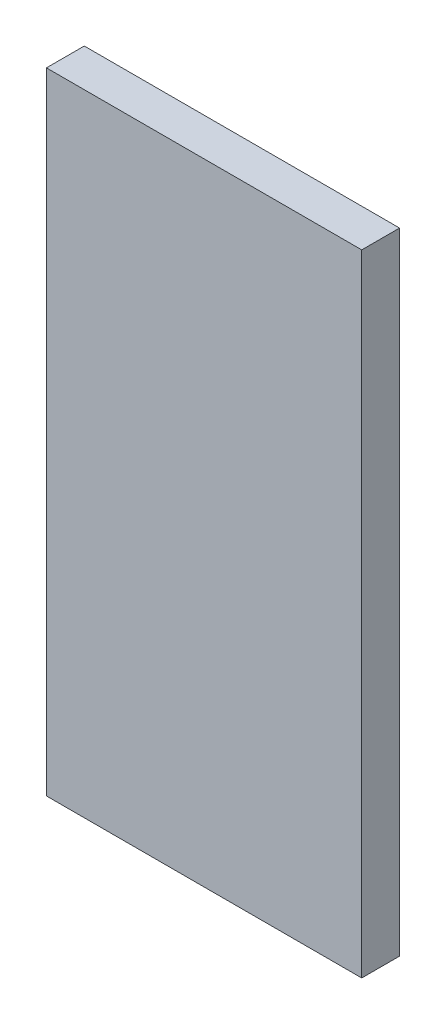
ISO-10303-21;
HEADER;
FILE_DESCRIPTION(('STEP AP214'),'2;1');
FILE_NAME('part.step','',(''),(''),'','','');
FILE_SCHEMA(('AUTOMOTIVE_DESIGN { 1 0 10303 214 1 1 1 1 }'));
ENDSEC;
DATA;
#1=APPLICATION_CONTEXT('core data for automotive mechanical design processes');
#2=APPLICATION_PROTOCOL_DEFINITION('international standard','automotive_design',2000,#1);
#3=PRODUCT_CONTEXT('',#1,'mechanical');
#4=PRODUCT('Part','Part','',(#3));
#5=PRODUCT_RELATED_PRODUCT_CATEGORY('part','',(#4));
#6=PRODUCT_DEFINITION_FORMATION('','',#4);
#7=PRODUCT_DEFINITION_CONTEXT('part definition',#1,'design');
#8=PRODUCT_DEFINITION('design','',#6,#7);
#9=PRODUCT_DEFINITION_SHAPE('','',#8);
#10=(LENGTH_UNIT() NAMED_UNIT(*) SI_UNIT(.MILLI.,.METRE.));
#11=(NAMED_UNIT(*) PLANE_ANGLE_UNIT() SI_UNIT($,.RADIAN.));
#12=(NAMED_UNIT(*) SI_UNIT($,.STERADIAN.) SOLID_ANGLE_UNIT());
#13=UNCERTAINTY_MEASURE_WITH_UNIT(LENGTH_MEASURE(1.E-05),#10,'distance_accuracy_value','');
#14=(GEOMETRIC_REPRESENTATION_CONTEXT(3) GLOBAL_UNCERTAINTY_ASSIGNED_CONTEXT((#13)) GLOBAL_UNIT_ASSIGNED_CONTEXT((#10,
#11,#12)) REPRESENTATION_CONTEXT('',''));
#15=CARTESIAN_POINT('',(0.,0.,0.));
#16=DIRECTION('',(0.,0.,1.));
#17=DIRECTION('',(1.,0.,0.));
#18=AXIS2_PLACEMENT_3D('',#15,#16,#17);
#19=CARTESIAN_POINT('',(-50.,-100.,12.));
#20=DIRECTION('',(1.,0.,0.));
#21=DIRECTION('',(0.,0.,-1.));
#22=AXIS2_PLACEMENT_3D('',#19,#20,#21);
#23=PLANE('',#22);
#24=DIRECTION('',(0.,-1.,0.));
#25=VECTOR('',#24,1.);
#26=CARTESIAN_POINT('',(-50.,-100.,0.));
#27=LINE('',#26,#25);
#28=CARTESIAN_POINT('',(-50.,100.,0.));
#29=VERTEX_POINT('',#28);
#30=CARTESIAN_POINT('',(-50.,-100.,0.));
#31=VERTEX_POINT('',#30);
#32=EDGE_CURVE('E96',#29,#31,#27,.T.);
#33=ORIENTED_EDGE('',*,*,#32,.T.);
#34=DIRECTION('',(0.,0.,-1.));
#35=VECTOR('',#34,1.);
#36=CARTESIAN_POINT('',(-50.,-100.,12.));
#37=LINE('',#36,#35);
#38=CARTESIAN_POINT('',(-50.,-100.,12.));
#39=VERTEX_POINT('',#38);
#40=EDGE_CURVE('E11',#39,#31,#37,.T.);
#41=ORIENTED_EDGE('',*,*,#40,.F.);
#42=DIRECTION('',(0.,-1.,0.));
#43=VECTOR('',#42,1.);
#44=CARTESIAN_POINT('',(-50.,-100.,12.));
#45=LINE('',#44,#43);
#46=CARTESIAN_POINT('',(-50.,100.,12.));
#47=VERTEX_POINT('',#46);
#48=EDGE_CURVE('E84',#47,#39,#45,.T.);
#49=ORIENTED_EDGE('',*,*,#48,.F.);
#50=DIRECTION('',(0.,0.,-1.));
#51=VECTOR('',#50,1.);
#52=CARTESIAN_POINT('',(-50.,100.,12.));
#53=LINE('',#52,#51);
#54=EDGE_CURVE('E92',#47,#29,#53,.T.);
#55=ORIENTED_EDGE('',*,*,#54,.T.);
#56=EDGE_LOOP('',(#33,#41,#49,#55));
#57=FACE_BOUND('',#56,.T.);
#58=ADVANCED_FACE('F33',(#57),#23,.F.);
#59=CARTESIAN_POINT('',(50.,-100.,12.));
#60=DIRECTION('',(0.,1.,0.));
#61=DIRECTION('',(0.,0.,1.));
#62=AXIS2_PLACEMENT_3D('',#59,#60,#61);
#63=PLANE('',#62);
#64=DIRECTION('',(1.,0.,0.));
#65=VECTOR('',#64,1.);
#66=CARTESIAN_POINT('',(50.,-100.,0.));
#67=LINE('',#66,#65);
#68=CARTESIAN_POINT('',(50.,-100.,0.));
#69=VERTEX_POINT('',#68);
#70=EDGE_CURVE('E88',#31,#69,#67,.T.);
#71=ORIENTED_EDGE('',*,*,#70,.T.);
#72=DIRECTION('',(0.,0.,-1.));
#73=VECTOR('',#72,1.);
#74=CARTESIAN_POINT('',(50.,-100.,12.));
#75=LINE('',#74,#73);
#76=CARTESIAN_POINT('',(50.,-100.,12.));
#77=VERTEX_POINT('',#76);
#78=EDGE_CURVE('E41',#77,#69,#75,.T.);
#79=ORIENTED_EDGE('',*,*,#78,.F.);
#80=DIRECTION('',(1.,0.,0.));
#81=VECTOR('',#80,1.);
#82=CARTESIAN_POINT('',(50.,-100.,12.));
#83=LINE('',#82,#81);
#84=EDGE_CURVE('E79',#39,#77,#83,.T.);
#85=ORIENTED_EDGE('',*,*,#84,.F.);
#86=ORIENTED_EDGE('',*,*,#40,.T.);
#87=EDGE_LOOP('',(#71,#79,#85,#86));
#88=FACE_BOUND('',#87,.T.);
#89=ADVANCED_FACE('F87',(#88),#63,.F.);
#90=CARTESIAN_POINT('',(50.,-100.,12.));
#91=DIRECTION('',(-1.,0.,0.));
#92=DIRECTION('',(0.,0.,1.));
#93=AXIS2_PLACEMENT_3D('',#90,#91,#92);
#94=PLANE('',#93);
#95=DIRECTION('',(0.,1.,0.));
#96=VECTOR('',#95,1.);
#97=CARTESIAN_POINT('',(50.,-100.,0.));
#98=LINE('',#97,#96);
#99=CARTESIAN_POINT('',(50.,100.,0.));
#100=VERTEX_POINT('',#99);
#101=EDGE_CURVE('E66',#69,#100,#98,.T.);
#102=ORIENTED_EDGE('',*,*,#101,.T.);
#103=DIRECTION('',(0.,0.,-1.));
#104=VECTOR('',#103,1.);
#105=CARTESIAN_POINT('',(50.,100.,12.));
#106=LINE('',#105,#104);
#107=CARTESIAN_POINT('',(50.,100.,12.));
#108=VERTEX_POINT('',#107);
#109=EDGE_CURVE('E89',#108,#100,#106,.T.);
#110=ORIENTED_EDGE('',*,*,#109,.F.);
#111=DIRECTION('',(0.,1.,0.));
#112=VECTOR('',#111,1.);
#113=CARTESIAN_POINT('',(50.,-100.,12.));
#114=LINE('',#113,#112);
#115=EDGE_CURVE('E82',#77,#108,#114,.T.);
#116=ORIENTED_EDGE('',*,*,#115,.F.);
#117=ORIENTED_EDGE('',*,*,#78,.T.);
#118=EDGE_LOOP('',(#102,#110,#116,#117));
#119=FACE_BOUND('',#118,.T.);
#120=ADVANCED_FACE('F90',(#119),#94,.F.);
#121=CARTESIAN_POINT('',(50.,100.,12.));
#122=DIRECTION('',(0.,-1.,0.));
#123=DIRECTION('',(1.,0.,0.));
#124=AXIS2_PLACEMENT_3D('',#121,#122,#123);
#125=PLANE('',#124);
#126=DIRECTION('',(-1.,0.,0.));
#127=VECTOR('',#126,1.);
#128=CARTESIAN_POINT('',(50.,100.,0.));
#129=LINE('',#128,#127);
#130=EDGE_CURVE('E72',#100,#29,#129,.T.);
#131=ORIENTED_EDGE('',*,*,#130,.T.);
#132=ORIENTED_EDGE('',*,*,#54,.F.);
#133=DIRECTION('',(-1.,0.,0.));
#134=VECTOR('',#133,1.);
#135=CARTESIAN_POINT('',(50.,100.,12.));
#136=LINE('',#135,#134);
#137=EDGE_CURVE('E49',#108,#47,#136,.T.);
#138=ORIENTED_EDGE('',*,*,#137,.F.);
#139=ORIENTED_EDGE('',*,*,#109,.T.);
#140=EDGE_LOOP('',(#131,#132,#138,#139));
#141=FACE_BOUND('',#140,.T.);
#142=ADVANCED_FACE('F103',(#141),#125,.F.);
#143=CARTESIAN_POINT('',(0.,0.,12.));
#144=DIRECTION('',(0.,0.,1.));
#145=DIRECTION('',(1.,0.,0.));
#146=AXIS2_PLACEMENT_3D('',#143,#144,#145);
#147=PLANE('',#146);
#148=ORIENTED_EDGE('',*,*,#48,.T.);
#149=ORIENTED_EDGE('',*,*,#84,.T.);
#150=ORIENTED_EDGE('',*,*,#115,.T.);
#151=ORIENTED_EDGE('',*,*,#137,.T.);
#152=EDGE_LOOP('',(#148,#149,#150,#151));
#153=FACE_BOUND('',#152,.T.);
#154=ADVANCED_FACE('F80',(#153),#147,.T.);
#155=CARTESIAN_POINT('',(0.,0.,0.));
#156=DIRECTION('',(0.,0.,1.));
#157=DIRECTION('',(1.,0.,0.));
#158=AXIS2_PLACEMENT_3D('',#155,#156,#157);
#159=PLANE('',#158);
#160=ORIENTED_EDGE('',*,*,#32,.F.);
#161=ORIENTED_EDGE('',*,*,#130,.F.);
#162=ORIENTED_EDGE('',*,*,#101,.F.);
#163=ORIENTED_EDGE('',*,*,#70,.F.);
#164=EDGE_LOOP('',(#160,#161,#162,#163));
#165=FACE_BOUND('',#164,.T.);
#166=ADVANCED_FACE('F106',(#165),#159,.F.);
#167=CLOSED_SHELL('',(#58,#89,#120,#142,#154,#166));
#168=MANIFOLD_SOLID_BREP('B2',#167);
#169=ADVANCED_BREP_SHAPE_REPRESENTATION('',(#18,#168),#14);
#170=SHAPE_DEFINITION_REPRESENTATION(#9,#169);
ENDSEC;
END-ISO-10303-21;
